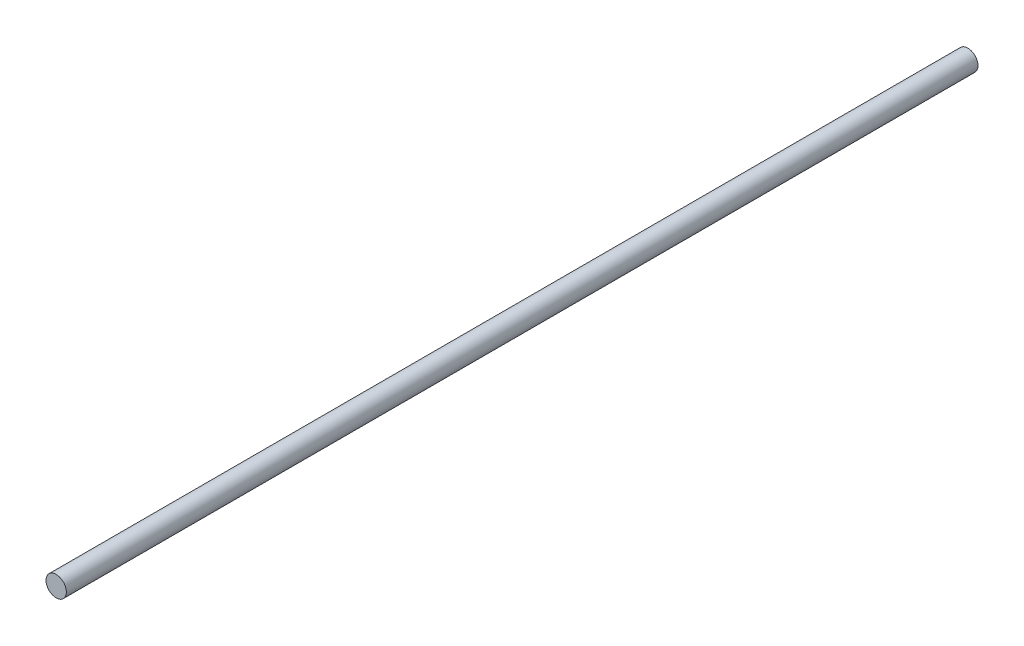
ISO-10303-21;
HEADER;
FILE_DESCRIPTION(('STEP AP214'),'2;1');
FILE_NAME('part.step','',(''),(''),'','','');
FILE_SCHEMA(('AUTOMOTIVE_DESIGN { 1 0 10303 214 1 1 1 1 }'));
ENDSEC;
DATA;
#1=APPLICATION_CONTEXT('core data for automotive mechanical design processes');
#2=APPLICATION_PROTOCOL_DEFINITION('international standard','automotive_design',2000,#1);
#3=PRODUCT_CONTEXT('',#1,'mechanical');
#4=PRODUCT('Part','Part','',(#3));
#5=PRODUCT_RELATED_PRODUCT_CATEGORY('part','',(#4));
#6=PRODUCT_DEFINITION_FORMATION('','',#4);
#7=PRODUCT_DEFINITION_CONTEXT('part definition',#1,'design');
#8=PRODUCT_DEFINITION('design','',#6,#7);
#9=PRODUCT_DEFINITION_SHAPE('','',#8);
#10=(LENGTH_UNIT() NAMED_UNIT(*) SI_UNIT(.MILLI.,.METRE.));
#11=(NAMED_UNIT(*) PLANE_ANGLE_UNIT() SI_UNIT($,.RADIAN.));
#12=(NAMED_UNIT(*) SI_UNIT($,.STERADIAN.) SOLID_ANGLE_UNIT());
#13=UNCERTAINTY_MEASURE_WITH_UNIT(LENGTH_MEASURE(1.E-05),#10,'distance_accuracy_value','');
#14=(GEOMETRIC_REPRESENTATION_CONTEXT(3) GLOBAL_UNCERTAINTY_ASSIGNED_CONTEXT((#13)) GLOBAL_UNIT_ASSIGNED_CONTEXT((#10,
#11,#12)) REPRESENTATION_CONTEXT('',''));
#15=CARTESIAN_POINT('',(0.,0.,0.));
#16=DIRECTION('',(0.,0.,1.));
#17=DIRECTION('',(1.,0.,0.));
#18=AXIS2_PLACEMENT_3D('',#15,#16,#17);
#19=CARTESIAN_POINT('',(10.0165574589457,-10.0165574589457,-300.));
#20=DIRECTION('',(0.,0.,1.));
#21=DIRECTION('',(1.,0.,0.));
#22=AXIS2_PLACEMENT_3D('',#19,#20,#21);
#23=CYLINDRICAL_SURFACE('',#22,3.79708670005155);
#24=CARTESIAN_POINT('',(10.0165574589457,-10.0165574589457,-300.));
#25=DIRECTION('',(0.,0.,1.));
#26=DIRECTION('',(1.,0.,0.));
#27=AXIS2_PLACEMENT_3D('',#24,#25,#26);
#28=CIRCLE('',#27,3.79708670005155);
#29=CARTESIAN_POINT('',(13.8136441589972,-10.0165574589457,-300.));
#30=VERTEX_POINT('',#29);
#31=EDGE_CURVE('E10',#30,#30,#28,.T.);
#32=ORIENTED_EDGE('',*,*,#31,.T.);
#33=EDGE_LOOP('',(#32));
#34=FACE_BOUND('',#33,.T.);
#35=CARTESIAN_POINT('',(10.0165574589457,-10.0165574589457,40.));
#36=DIRECTION('',(0.,0.,1.));
#37=DIRECTION('',(1.,0.,0.));
#38=AXIS2_PLACEMENT_3D('',#35,#36,#37);
#39=CIRCLE('',#38,3.79708670005155);
#40=CARTESIAN_POINT('',(13.8136441589972,-10.0165574589457,40.));
#41=VERTEX_POINT('',#40);
#42=EDGE_CURVE('E37',#41,#41,#39,.T.);
#43=ORIENTED_EDGE('',*,*,#42,.F.);
#44=EDGE_LOOP('',(#43));
#45=FACE_BOUND('',#44,.T.);
#46=ADVANCED_FACE('F31',(#34,#45),#23,.T.);
#47=CARTESIAN_POINT('',(10.0165574589457,-10.0165574589457,-300.));
#48=DIRECTION('',(0.,0.,1.));
#49=DIRECTION('',(1.,0.,0.));
#50=AXIS2_PLACEMENT_3D('',#47,#48,#49);
#51=PLANE('',#50);
#52=ORIENTED_EDGE('',*,*,#31,.F.);
#53=EDGE_LOOP('',(#52));
#54=FACE_BOUND('',#53,.T.);
#55=ADVANCED_FACE('F46',(#54),#51,.F.);
#56=CARTESIAN_POINT('',(10.0165574589457,-10.0165574589457,40.));
#57=DIRECTION('',(0.,0.,1.));
#58=DIRECTION('',(1.,0.,0.));
#59=AXIS2_PLACEMENT_3D('',#56,#57,#58);
#60=PLANE('',#59);
#61=ORIENTED_EDGE('',*,*,#42,.T.);
#62=EDGE_LOOP('',(#61));
#63=FACE_BOUND('',#62,.T.);
#64=ADVANCED_FACE('F43',(#63),#60,.T.);
#65=CLOSED_SHELL('',(#46,#55,#64));
#66=MANIFOLD_SOLID_BREP('B2',#65);
#67=ADVANCED_BREP_SHAPE_REPRESENTATION('',(#18,#66),#14);
#68=SHAPE_DEFINITION_REPRESENTATION(#9,#67);
ENDSEC;
END-ISO-10303-21;
